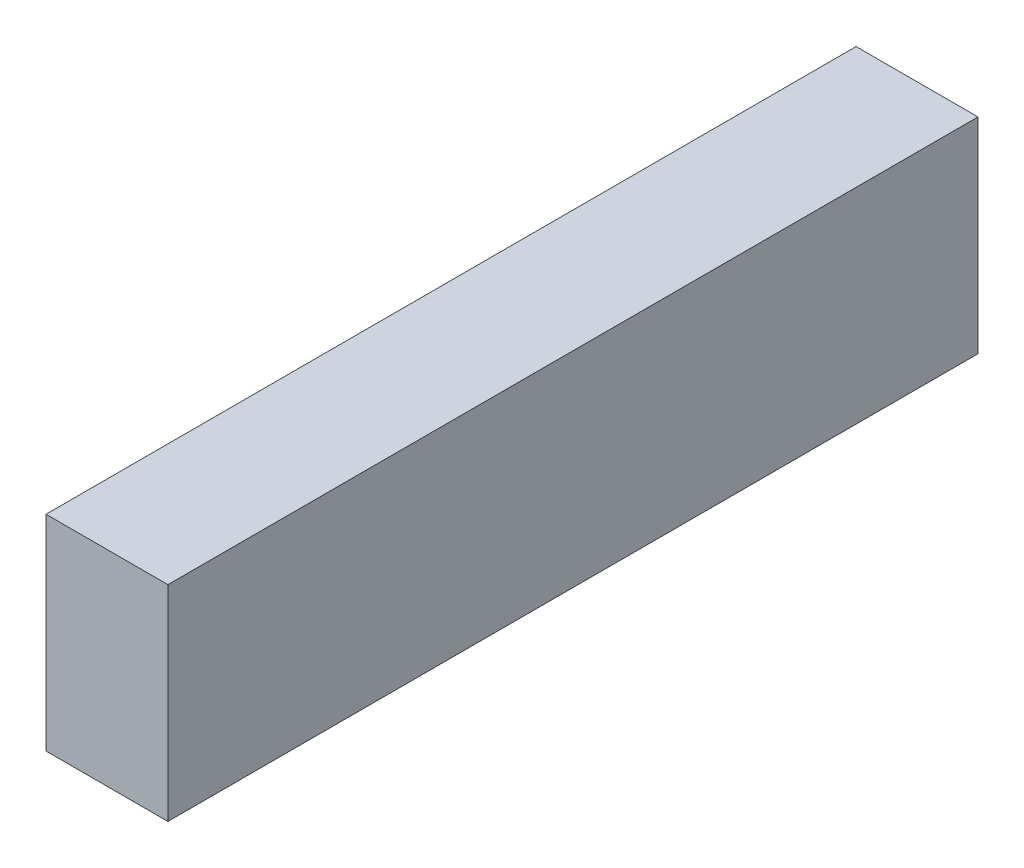
ISO-10303-21;
HEADER;
FILE_DESCRIPTION(('STEP AP214'),'2;1');
FILE_NAME('part.step','',(''),(''),'','','');
FILE_SCHEMA(('AUTOMOTIVE_DESIGN { 1 0 10303 214 1 1 1 1 }'));
ENDSEC;
DATA;
#1=APPLICATION_CONTEXT('core data for automotive mechanical design processes');
#2=APPLICATION_PROTOCOL_DEFINITION('international standard','automotive_design',2000,#1);
#3=PRODUCT_CONTEXT('',#1,'mechanical');
#4=PRODUCT('Part','Part','',(#3));
#5=PRODUCT_RELATED_PRODUCT_CATEGORY('part','',(#4));
#6=PRODUCT_DEFINITION_FORMATION('','',#4);
#7=PRODUCT_DEFINITION_CONTEXT('part definition',#1,'design');
#8=PRODUCT_DEFINITION('design','',#6,#7);
#9=PRODUCT_DEFINITION_SHAPE('','',#8);
#10=(LENGTH_UNIT() NAMED_UNIT(*) SI_UNIT(.MILLI.,.METRE.));
#11=(NAMED_UNIT(*) PLANE_ANGLE_UNIT() SI_UNIT($,.RADIAN.));
#12=(NAMED_UNIT(*) SI_UNIT($,.STERADIAN.) SOLID_ANGLE_UNIT());
#13=UNCERTAINTY_MEASURE_WITH_UNIT(LENGTH_MEASURE(1.E-05),#10,'distance_accuracy_value','');
#14=(GEOMETRIC_REPRESENTATION_CONTEXT(3) GLOBAL_UNCERTAINTY_ASSIGNED_CONTEXT((#13)) GLOBAL_UNIT_ASSIGNED_CONTEXT((#10,
#11,#12)) REPRESENTATION_CONTEXT('',''));
#15=CARTESIAN_POINT('',(0.,0.,0.));
#16=DIRECTION('',(0.,0.,1.));
#17=DIRECTION('',(1.,0.,0.));
#18=AXIS2_PLACEMENT_3D('',#15,#16,#17);
#19=CARTESIAN_POINT('',(0.,20.,79.));
#20=DIRECTION('',(1.,0.,0.));
#21=DIRECTION('',(0.,1.,0.));
#22=AXIS2_PLACEMENT_3D('',#19,#20,#21);
#23=PLANE('',#22);
#24=CARTESIAN_POINT('',(0.,9.99999999999981,9.5));
#25=DIRECTION('',(-1.,0.,0.));
#26=DIRECTION('',(0.,-1.,0.));
#27=AXIS2_PLACEMENT_3D('',#24,#25,#26);
#28=CIRCLE('',#27,2.15);
#29=CARTESIAN_POINT('',(0.,7.84999999999981,9.5));
#30=VERTEX_POINT('',#29);
#31=EDGE_CURVE('E117',#30,#30,#28,.T.);
#32=ORIENTED_EDGE('',*,*,#31,.F.);
#33=EDGE_LOOP('',(#32));
#34=FACE_BOUND('',#33,.T.);
#35=CARTESIAN_POINT('',(0.,10.,69.5));
#36=DIRECTION('',(-1.,0.,0.));
#37=DIRECTION('',(0.,-1.,0.));
#38=AXIS2_PLACEMENT_3D('',#35,#36,#37);
#39=CIRCLE('',#38,2.15);
#40=CARTESIAN_POINT('',(0.,7.85000000000001,69.5));
#41=VERTEX_POINT('',#40);
#42=EDGE_CURVE('E124',#41,#41,#39,.T.);
#43=ORIENTED_EDGE('',*,*,#42,.F.);
#44=EDGE_LOOP('',(#43));
#45=FACE_BOUND('',#44,.T.);
#46=CARTESIAN_POINT('',(0.,10.,39.5));
#47=DIRECTION('',(-1.,0.,0.));
#48=DIRECTION('',(0.,-1.,0.));
#49=AXIS2_PLACEMENT_3D('',#46,#47,#48);
#50=CIRCLE('',#49,2.15);
#51=CARTESIAN_POINT('',(0.,7.85000000000001,39.5));
#52=VERTEX_POINT('',#51);
#53=EDGE_CURVE('E111',#52,#52,#50,.T.);
#54=ORIENTED_EDGE('',*,*,#53,.F.);
#55=EDGE_LOOP('',(#54));
#56=FACE_BOUND('',#55,.T.);
#57=DIRECTION('',(0.,-1.,0.));
#58=VECTOR('',#57,1.);
#59=CARTESIAN_POINT('',(0.,20.,0.));
#60=LINE('',#59,#58);
#61=CARTESIAN_POINT('',(0.,20.,0.));
#62=VERTEX_POINT('',#61);
#63=CARTESIAN_POINT('',(0.,0.,0.));
#64=VERTEX_POINT('',#63);
#65=EDGE_CURVE('E97',#62,#64,#60,.T.);
#66=ORIENTED_EDGE('',*,*,#65,.T.);
#67=DIRECTION('',(0.,0.,-1.));
#68=VECTOR('',#67,1.);
#69=CARTESIAN_POINT('',(0.,0.,79.));
#70=LINE('',#69,#68);
#71=CARTESIAN_POINT('',(0.,0.,79.));
#72=VERTEX_POINT('',#71);
#73=EDGE_CURVE('E11',#72,#64,#70,.T.);
#74=ORIENTED_EDGE('',*,*,#73,.F.);
#75=DIRECTION('',(0.,-1.,0.));
#76=VECTOR('',#75,1.);
#77=CARTESIAN_POINT('',(0.,20.,79.));
#78=LINE('',#77,#76);
#79=CARTESIAN_POINT('',(0.,20.,79.));
#80=VERTEX_POINT('',#79);
#81=EDGE_CURVE('E85',#80,#72,#78,.T.);
#82=ORIENTED_EDGE('',*,*,#81,.F.);
#83=DIRECTION('',(0.,0.,-1.));
#84=VECTOR('',#83,1.);
#85=CARTESIAN_POINT('',(0.,20.,79.));
#86=LINE('',#85,#84);
#87=EDGE_CURVE('E93',#80,#62,#86,.T.);
#88=ORIENTED_EDGE('',*,*,#87,.T.);
#89=EDGE_LOOP('',(#66,#74,#82,#88));
#90=FACE_BOUND('',#89,.T.);
#91=ADVANCED_FACE('F34',(#34,#45,#56,#90),#23,.F.);
#92=CARTESIAN_POINT('',(0.,0.,79.));
#93=DIRECTION('',(0.,1.,0.));
#94=DIRECTION('',(0.,0.,1.));
#95=AXIS2_PLACEMENT_3D('',#92,#93,#94);
#96=PLANE('',#95);
#97=CARTESIAN_POINT('',(5.945,0.,9.5));
#98=DIRECTION('',(0.,-1.,0.));
#99=DIRECTION('',(0.,0.,-1.));
#100=AXIS2_PLACEMENT_3D('',#97,#98,#99);
#101=CIRCLE('',#100,2.15);
#102=CARTESIAN_POINT('',(5.945,0.,7.35));
#103=VERTEX_POINT('',#102);
#104=EDGE_CURVE('E135',#103,#103,#101,.T.);
#105=ORIENTED_EDGE('',*,*,#104,.F.);
#106=EDGE_LOOP('',(#105));
#107=FACE_BOUND('',#106,.T.);
#108=CARTESIAN_POINT('',(5.945,0.,69.5));
#109=DIRECTION('',(0.,-1.,0.));
#110=DIRECTION('',(0.,0.,-1.));
#111=AXIS2_PLACEMENT_3D('',#108,#109,#110);
#112=CIRCLE('',#111,2.15);
#113=CARTESIAN_POINT('',(5.945,0.,67.35));
#114=VERTEX_POINT('',#113);
#115=EDGE_CURVE('E141',#114,#114,#112,.T.);
#116=ORIENTED_EDGE('',*,*,#115,.F.);
#117=EDGE_LOOP('',(#116));
#118=FACE_BOUND('',#117,.T.);
#119=CARTESIAN_POINT('',(5.945,0.,39.5));
#120=DIRECTION('',(0.,-1.,0.));
#121=DIRECTION('',(0.,0.,-1.));
#122=AXIS2_PLACEMENT_3D('',#119,#120,#121);
#123=CIRCLE('',#122,2.15);
#124=CARTESIAN_POINT('',(5.945,0.,37.35));
#125=VERTEX_POINT('',#124);
#126=EDGE_CURVE('E129',#125,#125,#123,.T.);
#127=ORIENTED_EDGE('',*,*,#126,.F.);
#128=EDGE_LOOP('',(#127));
#129=FACE_BOUND('',#128,.T.);
#130=DIRECTION('',(1.,0.,0.));
#131=VECTOR('',#130,1.);
#132=CARTESIAN_POINT('',(0.,0.,0.));
#133=LINE('',#132,#131);
#134=CARTESIAN_POINT('',(11.89,0.,0.));
#135=VERTEX_POINT('',#134);
#136=EDGE_CURVE('E89',#64,#135,#133,.T.);
#137=ORIENTED_EDGE('',*,*,#136,.T.);
#138=DIRECTION('',(0.,0.,-1.));
#139=VECTOR('',#138,1.);
#140=CARTESIAN_POINT('',(11.89,0.,79.));
#141=LINE('',#140,#139);
#142=CARTESIAN_POINT('',(11.89,0.,79.));
#143=VERTEX_POINT('',#142);
#144=EDGE_CURVE('E42',#143,#135,#141,.T.);
#145=ORIENTED_EDGE('',*,*,#144,.F.);
#146=DIRECTION('',(1.,0.,0.));
#147=VECTOR('',#146,1.);
#148=CARTESIAN_POINT('',(0.,0.,79.));
#149=LINE('',#148,#147);
#150=EDGE_CURVE('E80',#72,#143,#149,.T.);
#151=ORIENTED_EDGE('',*,*,#150,.F.);
#152=ORIENTED_EDGE('',*,*,#73,.T.);
#153=EDGE_LOOP('',(#137,#145,#151,#152));
#154=FACE_BOUND('',#153,.T.);
#155=ADVANCED_FACE('F88',(#107,#118,#129,#154),#96,.F.);
#156=CARTESIAN_POINT('',(11.89,0.,79.));
#157=DIRECTION('',(-1.,0.,0.));
#158=DIRECTION('',(0.,-1.,0.));
#159=AXIS2_PLACEMENT_3D('',#156,#157,#158);
#160=PLANE('',#159);
#161=DIRECTION('',(0.,1.,0.));
#162=VECTOR('',#161,1.);
#163=CARTESIAN_POINT('',(11.89,0.,0.));
#164=LINE('',#163,#162);
#165=CARTESIAN_POINT('',(11.89,20.,0.));
#166=VERTEX_POINT('',#165);
#167=EDGE_CURVE('E67',#135,#166,#164,.T.);
#168=ORIENTED_EDGE('',*,*,#167,.T.);
#169=DIRECTION('',(0.,0.,-1.));
#170=VECTOR('',#169,1.);
#171=CARTESIAN_POINT('',(11.89,20.,79.));
#172=LINE('',#171,#170);
#173=CARTESIAN_POINT('',(11.89,20.,79.));
#174=VERTEX_POINT('',#173);
#175=EDGE_CURVE('E90',#174,#166,#172,.T.);
#176=ORIENTED_EDGE('',*,*,#175,.F.);
#177=DIRECTION('',(0.,1.,0.));
#178=VECTOR('',#177,1.);
#179=CARTESIAN_POINT('',(11.89,0.,79.));
#180=LINE('',#179,#178);
#181=EDGE_CURVE('E83',#143,#174,#180,.T.);
#182=ORIENTED_EDGE('',*,*,#181,.F.);
#183=ORIENTED_EDGE('',*,*,#144,.T.);
#184=EDGE_LOOP('',(#168,#176,#182,#183));
#185=FACE_BOUND('',#184,.T.);
#186=ADVANCED_FACE('F91',(#185),#160,.F.);
#187=CARTESIAN_POINT('',(11.89,20.,79.));
#188=DIRECTION('',(0.,-1.,0.));
#189=DIRECTION('',(1.,0.,0.));
#190=AXIS2_PLACEMENT_3D('',#187,#188,#189);
#191=PLANE('',#190);
#192=DIRECTION('',(-1.,0.,0.));
#193=VECTOR('',#192,1.);
#194=CARTESIAN_POINT('',(11.89,20.,0.));
#195=LINE('',#194,#193);
#196=EDGE_CURVE('E73',#166,#62,#195,.T.);
#197=ORIENTED_EDGE('',*,*,#196,.T.);
#198=ORIENTED_EDGE('',*,*,#87,.F.);
#199=DIRECTION('',(-1.,0.,0.));
#200=VECTOR('',#199,1.);
#201=CARTESIAN_POINT('',(11.89,20.,79.));
#202=LINE('',#201,#200);
#203=EDGE_CURVE('E50',#174,#80,#202,.T.);
#204=ORIENTED_EDGE('',*,*,#203,.F.);
#205=ORIENTED_EDGE('',*,*,#175,.T.);
#206=EDGE_LOOP('',(#197,#198,#204,#205));
#207=FACE_BOUND('',#206,.T.);
#208=ADVANCED_FACE('F105',(#207),#191,.F.);
#209=CARTESIAN_POINT('',(0.,0.,79.));
#210=DIRECTION('',(0.,0.,1.));
#211=DIRECTION('',(1.,0.,0.));
#212=AXIS2_PLACEMENT_3D('',#209,#210,#211);
#213=PLANE('',#212);
#214=ORIENTED_EDGE('',*,*,#81,.T.);
#215=ORIENTED_EDGE('',*,*,#150,.T.);
#216=ORIENTED_EDGE('',*,*,#181,.T.);
#217=ORIENTED_EDGE('',*,*,#203,.T.);
#218=EDGE_LOOP('',(#214,#215,#216,#217));
#219=FACE_BOUND('',#218,.T.);
#220=ADVANCED_FACE('F81',(#219),#213,.T.);
#221=CARTESIAN_POINT('',(0.,0.,0.));
#222=DIRECTION('',(0.,0.,1.));
#223=DIRECTION('',(1.,0.,0.));
#224=AXIS2_PLACEMENT_3D('',#221,#222,#223);
#225=PLANE('',#224);
#226=ORIENTED_EDGE('',*,*,#65,.F.);
#227=ORIENTED_EDGE('',*,*,#196,.F.);
#228=ORIENTED_EDGE('',*,*,#167,.F.);
#229=ORIENTED_EDGE('',*,*,#136,.F.);
#230=EDGE_LOOP('',(#226,#227,#228,#229));
#231=FACE_BOUND('',#230,.T.);
#232=ADVANCED_FACE('F108',(#231),#225,.F.);
#233=CARTESIAN_POINT('',(6.82000000000003,9.99999999999999,39.5));
#234=DIRECTION('',(-1.,0.,0.));
#235=DIRECTION('',(0.,-1.,0.));
#236=AXIS2_PLACEMENT_3D('',#233,#234,#235);
#237=CYLINDRICAL_SURFACE('',#236,2.15);
#238=CARTESIAN_POINT('',(6.82000000000003,9.99999999999999,39.5));
#239=DIRECTION('',(-1.,0.,0.));
#240=DIRECTION('',(0.,-1.,0.));
#241=AXIS2_PLACEMENT_3D('',#238,#239,#240);
#242=CIRCLE('',#241,2.15);
#243=CARTESIAN_POINT('',(6.82000000000003,7.84999999999999,39.5));
#244=VERTEX_POINT('',#243);
#245=EDGE_CURVE('E100',#244,#244,#242,.T.);
#246=ORIENTED_EDGE('',*,*,#245,.F.);
#247=EDGE_LOOP('',(#246));
#248=FACE_BOUND('',#247,.T.);
#249=ORIENTED_EDGE('',*,*,#53,.T.);
#250=EDGE_LOOP('',(#249));
#251=FACE_BOUND('',#250,.T.);
#252=ADVANCED_FACE('F188',(#248,#251),#237,.F.);
#253=CARTESIAN_POINT('',(6.82000000000003,9.99999999999999,39.5));
#254=DIRECTION('',(-1.,0.,0.));
#255=DIRECTION('',(0.,-1.,0.));
#256=AXIS2_PLACEMENT_3D('',#253,#254,#255);
#257=PLANE('',#256);
#258=ORIENTED_EDGE('',*,*,#245,.T.);
#259=EDGE_LOOP('',(#258));
#260=FACE_BOUND('',#259,.T.);
#261=ADVANCED_FACE('F190',(#260),#257,.T.);
#262=CARTESIAN_POINT('',(6.82000000000003,9.99999999999999,69.5));
#263=DIRECTION('',(-1.,0.,0.));
#264=DIRECTION('',(0.,-1.,0.));
#265=AXIS2_PLACEMENT_3D('',#262,#263,#264);
#266=CYLINDRICAL_SURFACE('',#265,2.15);
#267=CARTESIAN_POINT('',(6.82000000000003,9.99999999999999,69.5));
#268=DIRECTION('',(-1.,0.,0.));
#269=DIRECTION('',(0.,-1.,0.));
#270=AXIS2_PLACEMENT_3D('',#267,#268,#269);
#271=CIRCLE('',#270,2.15);
#272=CARTESIAN_POINT('',(6.82000000000003,7.84999999999999,69.5));
#273=VERTEX_POINT('',#272);
#274=EDGE_CURVE('E114',#273,#273,#271,.T.);
#275=ORIENTED_EDGE('',*,*,#274,.F.);
#276=EDGE_LOOP('',(#275));
#277=FACE_BOUND('',#276,.T.);
#278=ORIENTED_EDGE('',*,*,#42,.T.);
#279=EDGE_LOOP('',(#278));
#280=FACE_BOUND('',#279,.T.);
#281=ADVANCED_FACE('F197',(#277,#280),#266,.F.);
#282=CARTESIAN_POINT('',(6.82000000000003,9.99999999999999,69.5));
#283=DIRECTION('',(-1.,0.,0.));
#284=DIRECTION('',(0.,-1.,0.));
#285=AXIS2_PLACEMENT_3D('',#282,#283,#284);
#286=PLANE('',#285);
#287=ORIENTED_EDGE('',*,*,#274,.T.);
#288=EDGE_LOOP('',(#287));
#289=FACE_BOUND('',#288,.T.);
#290=ADVANCED_FACE('F248',(#289),#286,.T.);
#291=CARTESIAN_POINT('',(6.82000000000003,9.99999999999979,9.5));
#292=DIRECTION('',(-1.,0.,0.));
#293=DIRECTION('',(0.,-1.,0.));
#294=AXIS2_PLACEMENT_3D('',#291,#292,#293);
#295=CYLINDRICAL_SURFACE('',#294,2.15);
#296=CARTESIAN_POINT('',(6.82000000000003,9.99999999999979,9.5));
#297=DIRECTION('',(-1.,0.,0.));
#298=DIRECTION('',(0.,-1.,0.));
#299=AXIS2_PLACEMENT_3D('',#296,#297,#298);
#300=CIRCLE('',#299,2.15);
#301=CARTESIAN_POINT('',(6.82000000000002,7.84999999999979,9.5));
#302=VERTEX_POINT('',#301);
#303=EDGE_CURVE('E120',#302,#302,#300,.T.);
#304=ORIENTED_EDGE('',*,*,#303,.F.);
#305=EDGE_LOOP('',(#304));
#306=FACE_BOUND('',#305,.T.);
#307=ORIENTED_EDGE('',*,*,#31,.T.);
#308=EDGE_LOOP('',(#307));
#309=FACE_BOUND('',#308,.T.);
#310=ADVANCED_FACE('F172',(#306,#309),#295,.F.);
#311=CARTESIAN_POINT('',(6.82000000000003,9.99999999999979,9.5));
#312=DIRECTION('',(-1.,0.,0.));
#313=DIRECTION('',(0.,-1.,0.));
#314=AXIS2_PLACEMENT_3D('',#311,#312,#313);
#315=PLANE('',#314);
#316=ORIENTED_EDGE('',*,*,#303,.T.);
#317=EDGE_LOOP('',(#316));
#318=FACE_BOUND('',#317,.T.);
#319=ADVANCED_FACE('F163',(#318),#315,.T.);
#320=CARTESIAN_POINT('',(5.945,6.825,39.5));
#321=DIRECTION('',(0.,-1.,0.));
#322=DIRECTION('',(0.,0.,-1.));
#323=AXIS2_PLACEMENT_3D('',#320,#321,#322);
#324=CYLINDRICAL_SURFACE('',#323,2.15);
#325=CARTESIAN_POINT('',(5.945,6.825,39.5));
#326=DIRECTION('',(0.,-1.,0.));
#327=DIRECTION('',(0.,0.,-1.));
#328=AXIS2_PLACEMENT_3D('',#325,#326,#327);
#329=CIRCLE('',#328,2.15);
#330=CARTESIAN_POINT('',(5.945,6.825,37.35));
#331=VERTEX_POINT('',#330);
#332=EDGE_CURVE('E121',#331,#331,#329,.T.);
#333=ORIENTED_EDGE('',*,*,#332,.F.);
#334=EDGE_LOOP('',(#333));
#335=FACE_BOUND('',#334,.T.);
#336=ORIENTED_EDGE('',*,*,#126,.T.);
#337=EDGE_LOOP('',(#336));
#338=FACE_BOUND('',#337,.T.);
#339=ADVANCED_FACE('F161',(#335,#338),#324,.F.);
#340=CARTESIAN_POINT('',(5.945,6.825,39.5));
#341=DIRECTION('',(0.,-1.,0.));
#342=DIRECTION('',(0.,0.,-1.));
#343=AXIS2_PLACEMENT_3D('',#340,#341,#342);
#344=PLANE('',#343);
#345=ORIENTED_EDGE('',*,*,#332,.T.);
#346=EDGE_LOOP('',(#345));
#347=FACE_BOUND('',#346,.T.);
#348=ADVANCED_FACE('F152',(#347),#344,.T.);
#349=CARTESIAN_POINT('',(5.945,6.825,69.5));
#350=DIRECTION('',(0.,-1.,0.));
#351=DIRECTION('',(0.,0.,-1.));
#352=AXIS2_PLACEMENT_3D('',#349,#350,#351);
#353=CYLINDRICAL_SURFACE('',#352,2.15);
#354=CARTESIAN_POINT('',(5.945,6.825,69.5));
#355=DIRECTION('',(0.,-1.,0.));
#356=DIRECTION('',(0.,0.,-1.));
#357=AXIS2_PLACEMENT_3D('',#354,#355,#356);
#358=CIRCLE('',#357,2.15);
#359=CARTESIAN_POINT('',(5.945,6.825,67.35));
#360=VERTEX_POINT('',#359);
#361=EDGE_CURVE('E132',#360,#360,#358,.T.);
#362=ORIENTED_EDGE('',*,*,#361,.F.);
#363=EDGE_LOOP('',(#362));
#364=FACE_BOUND('',#363,.T.);
#365=ORIENTED_EDGE('',*,*,#115,.T.);
#366=EDGE_LOOP('',(#365));
#367=FACE_BOUND('',#366,.T.);
#368=ADVANCED_FACE('F149',(#364,#367),#353,.F.);
#369=CARTESIAN_POINT('',(5.945,6.825,69.5));
#370=DIRECTION('',(0.,-1.,0.));
#371=DIRECTION('',(0.,0.,-1.));
#372=AXIS2_PLACEMENT_3D('',#369,#370,#371);
#373=PLANE('',#372);
#374=ORIENTED_EDGE('',*,*,#361,.T.);
#375=EDGE_LOOP('',(#374));
#376=FACE_BOUND('',#375,.T.);
#377=ADVANCED_FACE('F147',(#376),#373,.T.);
#378=CARTESIAN_POINT('',(5.945,6.825,9.5));
#379=DIRECTION('',(0.,-1.,0.));
#380=DIRECTION('',(0.,0.,-1.));
#381=AXIS2_PLACEMENT_3D('',#378,#379,#380);
#382=CYLINDRICAL_SURFACE('',#381,2.15);
#383=CARTESIAN_POINT('',(5.945,6.825,9.5));
#384=DIRECTION('',(0.,-1.,0.));
#385=DIRECTION('',(0.,0.,-1.));
#386=AXIS2_PLACEMENT_3D('',#383,#384,#385);
#387=CIRCLE('',#386,2.15);
#388=CARTESIAN_POINT('',(5.945,6.825,7.35));
#389=VERTEX_POINT('',#388);
#390=EDGE_CURVE('E138',#389,#389,#387,.T.);
#391=ORIENTED_EDGE('',*,*,#390,.F.);
#392=EDGE_LOOP('',(#391));
#393=FACE_BOUND('',#392,.T.);
#394=ORIENTED_EDGE('',*,*,#104,.T.);
#395=EDGE_LOOP('',(#394));
#396=FACE_BOUND('',#395,.T.);
#397=ADVANCED_FACE('F297',(#393,#396),#382,.F.);
#398=CARTESIAN_POINT('',(5.945,6.825,9.5));
#399=DIRECTION('',(0.,-1.,0.));
#400=DIRECTION('',(0.,0.,-1.));
#401=AXIS2_PLACEMENT_3D('',#398,#399,#400);
#402=PLANE('',#401);
#403=ORIENTED_EDGE('',*,*,#390,.T.);
#404=EDGE_LOOP('',(#403));
#405=FACE_BOUND('',#404,.T.);
#406=ADVANCED_FACE('F306',(#405),#402,.T.);
#407=CLOSED_SHELL('',(#91,#155,#186,#208,#220,#232,#252,#261,#281,#290,#310,#319,#339,#348,#368,
#377,#397,#406));
#408=MANIFOLD_SOLID_BREP('B2',#407);
#409=ADVANCED_BREP_SHAPE_REPRESENTATION('',(#18,#408),#14);
#410=SHAPE_DEFINITION_REPRESENTATION(#9,#409);
ENDSEC;
END-ISO-10303-21;
